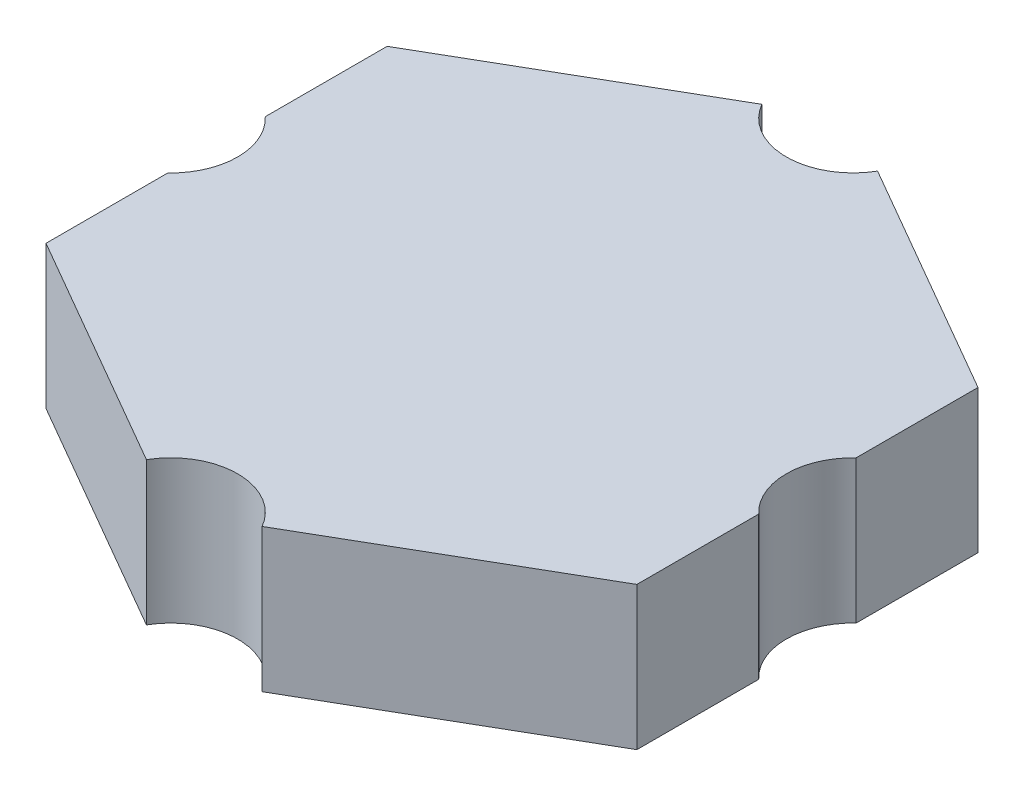
ISO-10303-21;
HEADER;
FILE_DESCRIPTION(('STEP AP214'),'2;1');
FILE_NAME('part.step','',(''),(''),'','','');
FILE_SCHEMA(('AUTOMOTIVE_DESIGN { 1 0 10303 214 1 1 1 1 }'));
ENDSEC;
DATA;
#1=APPLICATION_CONTEXT('core data for automotive mechanical design processes');
#2=APPLICATION_PROTOCOL_DEFINITION('international standard','automotive_design',2000,#1);
#3=PRODUCT_CONTEXT('',#1,'mechanical');
#4=PRODUCT('Part','Part','',(#3));
#5=PRODUCT_RELATED_PRODUCT_CATEGORY('part','',(#4));
#6=PRODUCT_DEFINITION_FORMATION('','',#4);
#7=PRODUCT_DEFINITION_CONTEXT('part definition',#1,'design');
#8=PRODUCT_DEFINITION('design','',#6,#7);
#9=PRODUCT_DEFINITION_SHAPE('','',#8);
#10=(LENGTH_UNIT() NAMED_UNIT(*) SI_UNIT(.MILLI.,.METRE.));
#11=(NAMED_UNIT(*) PLANE_ANGLE_UNIT() SI_UNIT($,.RADIAN.));
#12=(NAMED_UNIT(*) SI_UNIT($,.STERADIAN.) SOLID_ANGLE_UNIT());
#13=UNCERTAINTY_MEASURE_WITH_UNIT(LENGTH_MEASURE(1.E-05),#10,'distance_accuracy_value','');
#14=(GEOMETRIC_REPRESENTATION_CONTEXT(3) GLOBAL_UNCERTAINTY_ASSIGNED_CONTEXT((#13)) GLOBAL_UNIT_ASSIGNED_CONTEXT((#10,
#11,#12)) REPRESENTATION_CONTEXT('',''));
#15=CARTESIAN_POINT('',(0.,0.,0.));
#16=DIRECTION('',(0.,0.,1.));
#17=DIRECTION('',(1.,0.,0.));
#18=AXIS2_PLACEMENT_3D('',#15,#16,#17);
#19=CARTESIAN_POINT('',(-6.19208163705874,3.,-3.575));
#20=DIRECTION('',(1.,0.,0.));
#21=DIRECTION('',(0.,0.,-1.));
#22=AXIS2_PLACEMENT_3D('',#19,#20,#21);
#23=PLANE('',#22);
#24=DIRECTION('',(0.,0.,1.));
#25=VECTOR('',#24,1.);
#26=CARTESIAN_POINT('',(-6.19208163705874,0.,-3.575));
#27=LINE('',#26,#25);
#28=CARTESIAN_POINT('',(-6.19208163705874,0.,-3.575));
#29=VERTEX_POINT('',#28);
#30=CARTESIAN_POINT('',(-6.19208163705874,0.,-1.02097620439455));
#31=VERTEX_POINT('',#30);
#32=EDGE_CURVE('E167',#29,#31,#27,.T.);
#33=ORIENTED_EDGE('',*,*,#32,.T.);
#34=DIRECTION('',(0.,1.,0.));
#35=VECTOR('',#34,1.);
#36=CARTESIAN_POINT('',(-6.19208163705874,-6.45,-1.02097620439455));
#37=LINE('',#36,#35);
#38=CARTESIAN_POINT('',(-6.19208163705874,3.,-1.02097620439455));
#39=VERTEX_POINT('',#38);
#40=EDGE_CURVE('E48',#31,#39,#37,.T.);
#41=ORIENTED_EDGE('',*,*,#40,.T.);
#42=DIRECTION('',(0.,0.,1.));
#43=VECTOR('',#42,1.);
#44=CARTESIAN_POINT('',(-6.19208163705874,3.,-3.575));
#45=LINE('',#44,#43);
#46=CARTESIAN_POINT('',(-6.19208163705874,3.,-3.575));
#47=VERTEX_POINT('',#46);
#48=EDGE_CURVE('E138',#47,#39,#45,.T.);
#49=ORIENTED_EDGE('',*,*,#48,.F.);
#50=DIRECTION('',(0.,-1.,0.));
#51=VECTOR('',#50,1.);
#52=CARTESIAN_POINT('',(-6.19208163705874,3.,-3.575));
#53=LINE('',#52,#51);
#54=EDGE_CURVE('E185',#47,#29,#53,.T.);
#55=ORIENTED_EDGE('',*,*,#54,.T.);
#56=EDGE_LOOP('',(#33,#41,#49,#55));
#57=FACE_BOUND('',#56,.T.);
#58=ADVANCED_FACE('F33',(#57),#23,.F.);
#59=CARTESIAN_POINT('',(6.19208163705874,3.,3.575));
#60=DIRECTION('',(-1.,0.,0.));
#61=DIRECTION('',(0.,0.,1.));
#62=AXIS2_PLACEMENT_3D('',#59,#60,#61);
#63=PLANE('',#62);
#64=DIRECTION('',(0.,0.,-1.));
#65=VECTOR('',#64,1.);
#66=CARTESIAN_POINT('',(6.19208163705874,0.,3.575));
#67=LINE('',#66,#65);
#68=CARTESIAN_POINT('',(6.19208163705874,0.,3.575));
#69=VERTEX_POINT('',#68);
#70=CARTESIAN_POINT('',(6.19208163705874,0.,1.02097620439417));
#71=VERTEX_POINT('',#70);
#72=EDGE_CURVE('E176',#69,#71,#67,.T.);
#73=ORIENTED_EDGE('',*,*,#72,.T.);
#74=DIRECTION('',(0.,1.,0.));
#75=VECTOR('',#74,1.);
#76=CARTESIAN_POINT('',(6.19208163705874,-6.45,1.02097620439417));
#77=LINE('',#76,#75);
#78=CARTESIAN_POINT('',(6.19208163705874,3.,1.02097620439417));
#79=VERTEX_POINT('',#78);
#80=EDGE_CURVE('E204',#71,#79,#77,.T.);
#81=ORIENTED_EDGE('',*,*,#80,.T.);
#82=DIRECTION('',(0.,0.,-1.));
#83=VECTOR('',#82,1.);
#84=CARTESIAN_POINT('',(6.19208163705874,3.,3.575));
#85=LINE('',#84,#83);
#86=CARTESIAN_POINT('',(6.19208163705874,3.,3.575));
#87=VERTEX_POINT('',#86);
#88=EDGE_CURVE('E156',#87,#79,#85,.T.);
#89=ORIENTED_EDGE('',*,*,#88,.F.);
#90=DIRECTION('',(0.,-1.,0.));
#91=VECTOR('',#90,1.);
#92=CARTESIAN_POINT('',(6.19208163705874,3.,3.575));
#93=LINE('',#92,#91);
#94=EDGE_CURVE('E181',#87,#69,#93,.T.);
#95=ORIENTED_EDGE('',*,*,#94,.T.);
#96=EDGE_LOOP('',(#73,#81,#89,#95));
#97=FACE_BOUND('',#96,.T.);
#98=ADVANCED_FACE('F202',(#97),#63,.F.);
#99=CARTESIAN_POINT('',(6.19208163705873,3.,-3.575));
#100=DIRECTION('',(-0.5,0.,0.866025403784439));
#101=DIRECTION('',(0.866025403784439,0.,0.5));
#102=AXIS2_PLACEMENT_3D('',#99,#100,#101);
#103=PLANE('',#102);
#104=DIRECTION('',(-0.866025403784439,0.,-0.5));
#105=VECTOR('',#104,1.);
#106=CARTESIAN_POINT('',(6.19208163705873,0.,-3.575));
#107=LINE('',#106,#105);
#108=CARTESIAN_POINT('',(6.19208163705873,0.,-3.575));
#109=VERTEX_POINT('',#108);
#110=CARTESIAN_POINT('',(1.21243556529821,0.,-6.45));
#111=VERTEX_POINT('',#110);
#112=EDGE_CURVE('E160',#109,#111,#107,.T.);
#113=ORIENTED_EDGE('',*,*,#112,.T.);
#114=DIRECTION('',(0.,1.,0.));
#115=VECTOR('',#114,1.);
#116=CARTESIAN_POINT('',(1.21243556529821,-6.45,-6.45));
#117=LINE('',#116,#115);
#118=CARTESIAN_POINT('',(1.21243556529821,3.,-6.45));
#119=VERTEX_POINT('',#118);
#120=EDGE_CURVE('E164',#111,#119,#117,.T.);
#121=ORIENTED_EDGE('',*,*,#120,.T.);
#122=DIRECTION('',(-0.866025403784439,0.,-0.5));
#123=VECTOR('',#122,1.);
#124=CARTESIAN_POINT('',(6.19208163705873,3.,-3.575));
#125=LINE('',#124,#123);
#126=CARTESIAN_POINT('',(6.19208163705873,3.,-3.575));
#127=VERTEX_POINT('',#126);
#128=EDGE_CURVE('E148',#127,#119,#125,.T.);
#129=ORIENTED_EDGE('',*,*,#128,.F.);
#130=DIRECTION('',(0.,-1.,0.));
#131=VECTOR('',#130,1.);
#132=CARTESIAN_POINT('',(6.19208163705873,3.,-3.575));
#133=LINE('',#132,#131);
#134=EDGE_CURVE('E159',#127,#109,#133,.T.);
#135=ORIENTED_EDGE('',*,*,#134,.T.);
#136=EDGE_LOOP('',(#113,#121,#129,#135));
#137=FACE_BOUND('',#136,.T.);
#138=ADVANCED_FACE('F35',(#137),#103,.F.);
#139=CARTESIAN_POINT('',(0.,3.,-7.15));
#140=DIRECTION('',(0.5,0.,0.866025403784438));
#141=DIRECTION('',(0.866025403784439,0.,-0.5));
#142=AXIS2_PLACEMENT_3D('',#139,#140,#141);
#143=PLANE('',#142);
#144=DIRECTION('',(-0.866025403784439,0.,0.5));
#145=VECTOR('',#144,1.);
#146=CARTESIAN_POINT('',(0.,3.,-7.15));
#147=LINE('',#146,#145);
#148=CARTESIAN_POINT('',(-1.21243556529822,3.,-6.45));
#149=VERTEX_POINT('',#148);
#150=EDGE_CURVE('E145',#149,#47,#147,.T.);
#151=ORIENTED_EDGE('',*,*,#150,.F.);
#152=DIRECTION('',(0.,1.,0.));
#153=VECTOR('',#152,1.);
#154=CARTESIAN_POINT('',(-1.21243556529822,-6.45,-6.45));
#155=LINE('',#154,#153);
#156=CARTESIAN_POINT('',(-1.21243556529822,0.,-6.45));
#157=VERTEX_POINT('',#156);
#158=EDGE_CURVE('E226',#149,#157,#155,.F.);
#159=ORIENTED_EDGE('',*,*,#158,.T.);
#160=DIRECTION('',(-0.866025403784439,0.,0.5));
#161=VECTOR('',#160,1.);
#162=CARTESIAN_POINT('',(0.,0.,-7.15));
#163=LINE('',#162,#161);
#164=EDGE_CURVE('E163',#157,#29,#163,.T.);
#165=ORIENTED_EDGE('',*,*,#164,.T.);
#166=ORIENTED_EDGE('',*,*,#54,.F.);
#167=EDGE_LOOP('',(#151,#159,#165,#166));
#168=FACE_BOUND('',#167,.T.);
#169=ADVANCED_FACE('F242',(#168),#143,.F.);
#170=CARTESIAN_POINT('',(-6.19208163705874,3.,1.02097620439495));
#171=VERTEX_POINT('',#170);
#172=CARTESIAN_POINT('',(-6.19208163705874,3.,3.575));
#173=VERTEX_POINT('',#172);
#174=EDGE_CURVE('E135',#171,#173,#45,.T.);
#175=ORIENTED_EDGE('',*,*,#174,.F.);
#176=DIRECTION('',(0.,1.,0.));
#177=VECTOR('',#176,1.);
#178=CARTESIAN_POINT('',(-6.19208163705874,-6.45,1.02097620439495));
#179=LINE('',#178,#177);
#180=CARTESIAN_POINT('',(-6.19208163705874,0.,1.02097620439495));
#181=VERTEX_POINT('',#180);
#182=EDGE_CURVE('E120',#171,#181,#179,.F.);
#183=ORIENTED_EDGE('',*,*,#182,.T.);
#184=CARTESIAN_POINT('',(-6.19208163705874,0.,3.575));
#185=VERTEX_POINT('',#184);
#186=EDGE_CURVE('E166',#181,#185,#27,.T.);
#187=ORIENTED_EDGE('',*,*,#186,.T.);
#188=DIRECTION('',(0.,-1.,0.));
#189=VECTOR('',#188,1.);
#190=CARTESIAN_POINT('',(-6.19208163705874,3.,3.575));
#191=LINE('',#190,#189);
#192=EDGE_CURVE('E143',#173,#185,#191,.T.);
#193=ORIENTED_EDGE('',*,*,#192,.F.);
#194=EDGE_LOOP('',(#175,#183,#187,#193));
#195=FACE_BOUND('',#194,.T.);
#196=ADVANCED_FACE('F141',(#195),#23,.F.);
#197=CARTESIAN_POINT('',(-6.19208163705874,3.,3.575));
#198=DIRECTION('',(0.5,0.,-0.866025403784439));
#199=DIRECTION('',(-0.866025403784439,0.,-0.5));
#200=AXIS2_PLACEMENT_3D('',#197,#198,#199);
#201=PLANE('',#200);
#202=DIRECTION('',(0.866025403784439,0.,0.5));
#203=VECTOR('',#202,1.);
#204=CARTESIAN_POINT('',(-6.19208163705874,0.,3.575));
#205=LINE('',#204,#203);
#206=CARTESIAN_POINT('',(-1.21243556529791,0.,6.45000000000018));
#207=VERTEX_POINT('',#206);
#208=EDGE_CURVE('E170',#185,#207,#205,.T.);
#209=ORIENTED_EDGE('',*,*,#208,.T.);
#210=DIRECTION('',(0.,1.,0.));
#211=VECTOR('',#210,1.);
#212=CARTESIAN_POINT('',(-1.21243556529791,-6.45,6.45000000000018));
#213=LINE('',#212,#211);
#214=CARTESIAN_POINT('',(-1.21243556529791,3.,6.45000000000018));
#215=VERTEX_POINT('',#214);
#216=EDGE_CURVE('E56',#207,#215,#213,.T.);
#217=ORIENTED_EDGE('',*,*,#216,.T.);
#218=DIRECTION('',(0.866025403784439,0.,0.5));
#219=VECTOR('',#218,1.);
#220=CARTESIAN_POINT('',(-6.19208163705874,3.,3.575));
#221=LINE('',#220,#219);
#222=EDGE_CURVE('E147',#173,#215,#221,.T.);
#223=ORIENTED_EDGE('',*,*,#222,.F.);
#224=ORIENTED_EDGE('',*,*,#192,.T.);
#225=EDGE_LOOP('',(#209,#217,#223,#224));
#226=FACE_BOUND('',#225,.T.);
#227=ADVANCED_FACE('F213',(#226),#201,.F.);
#228=CARTESIAN_POINT('',(0.,3.,7.15));
#229=DIRECTION('',(-0.5,0.,-0.866025403784439));
#230=DIRECTION('',(-0.866025403784439,0.,0.5));
#231=AXIS2_PLACEMENT_3D('',#228,#229,#230);
#232=PLANE('',#231);
#233=DIRECTION('',(0.866025403784439,0.,-0.5));
#234=VECTOR('',#233,1.);
#235=CARTESIAN_POINT('',(0.,3.,7.15));
#236=LINE('',#235,#234);
#237=CARTESIAN_POINT('',(1.21243556529852,3.,6.44999999999983));
#238=VERTEX_POINT('',#237);
#239=EDGE_CURVE('E153',#238,#87,#236,.T.);
#240=ORIENTED_EDGE('',*,*,#239,.F.);
#241=DIRECTION('',(0.,1.,0.));
#242=VECTOR('',#241,1.);
#243=CARTESIAN_POINT('',(1.21243556529852,-6.45,6.44999999999983));
#244=LINE('',#243,#242);
#245=CARTESIAN_POINT('',(1.21243556529852,0.,6.44999999999983));
#246=VERTEX_POINT('',#245);
#247=EDGE_CURVE('E210',#238,#246,#244,.F.);
#248=ORIENTED_EDGE('',*,*,#247,.T.);
#249=DIRECTION('',(0.866025403784439,0.,-0.5));
#250=VECTOR('',#249,1.);
#251=CARTESIAN_POINT('',(0.,0.,7.15));
#252=LINE('',#251,#250);
#253=EDGE_CURVE('E173',#246,#69,#252,.T.);
#254=ORIENTED_EDGE('',*,*,#253,.T.);
#255=ORIENTED_EDGE('',*,*,#94,.F.);
#256=EDGE_LOOP('',(#240,#248,#254,#255));
#257=FACE_BOUND('',#256,.T.);
#258=ADVANCED_FACE('F208',(#257),#232,.F.);
#259=CARTESIAN_POINT('',(6.19208163705874,3.,-1.02097620439458));
#260=VERTEX_POINT('',#259);
#261=EDGE_CURVE('E155',#260,#127,#85,.T.);
#262=ORIENTED_EDGE('',*,*,#261,.F.);
#263=DIRECTION('',(0.,1.,0.));
#264=VECTOR('',#263,1.);
#265=CARTESIAN_POINT('',(6.19208163705874,-6.45,-1.02097620439458));
#266=LINE('',#265,#264);
#267=CARTESIAN_POINT('',(6.19208163705874,0.,-1.02097620439458));
#268=VERTEX_POINT('',#267);
#269=EDGE_CURVE('E223',#260,#268,#266,.F.);
#270=ORIENTED_EDGE('',*,*,#269,.T.);
#271=EDGE_CURVE('E175',#268,#109,#67,.T.);
#272=ORIENTED_EDGE('',*,*,#271,.T.);
#273=ORIENTED_EDGE('',*,*,#134,.F.);
#274=EDGE_LOOP('',(#262,#270,#272,#273));
#275=FACE_BOUND('',#274,.T.);
#276=ADVANCED_FACE('F250',(#275),#63,.F.);
#277=CARTESIAN_POINT('',(0.,3.,0.));
#278=DIRECTION('',(0.,1.,0.));
#279=DIRECTION('',(0.,0.,1.));
#280=AXIS2_PLACEMENT_3D('',#277,#278,#279);
#281=PLANE('',#280);
#282=CARTESIAN_POINT('',(0.,3.,-7.15));
#283=DIRECTION('',(0.,1.,0.));
#284=DIRECTION('',(0.,0.,1.));
#285=AXIS2_PLACEMENT_3D('',#282,#283,#284);
#286=CIRCLE('',#285,1.4);
#287=EDGE_CURVE('E128',#149,#119,#286,.T.);
#288=ORIENTED_EDGE('',*,*,#287,.F.);
#289=ORIENTED_EDGE('',*,*,#150,.T.);
#290=ORIENTED_EDGE('',*,*,#48,.T.);
#291=CARTESIAN_POINT('',(-7.1499999999998,3.,2.02777411196693E-13));
#292=DIRECTION('',(0.,1.,0.));
#293=DIRECTION('',(0.,0.,1.));
#294=AXIS2_PLACEMENT_3D('',#291,#292,#293);
#295=CIRCLE('',#294,1.4);
#296=EDGE_CURVE('E123',#171,#39,#295,.T.);
#297=ORIENTED_EDGE('',*,*,#296,.F.);
#298=ORIENTED_EDGE('',*,*,#174,.T.);
#299=ORIENTED_EDGE('',*,*,#222,.T.);
#300=CARTESIAN_POINT('',(4.02092781214988E-13,3.,7.15));
#301=DIRECTION('',(0.,1.,0.));
#302=DIRECTION('',(0.,0.,1.));
#303=AXIS2_PLACEMENT_3D('',#300,#301,#302);
#304=CIRCLE('',#303,1.4);
#305=EDGE_CURVE('E139',#238,#215,#304,.T.);
#306=ORIENTED_EDGE('',*,*,#305,.F.);
#307=ORIENTED_EDGE('',*,*,#239,.T.);
#308=ORIENTED_EDGE('',*,*,#88,.T.);
#309=CARTESIAN_POINT('',(7.1500000000002,3.,-2.01901788735303E-13));
#310=DIRECTION('',(0.,1.,0.));
#311=DIRECTION('',(0.,0.,1.));
#312=AXIS2_PLACEMENT_3D('',#309,#310,#311);
#313=CIRCLE('',#312,1.4);
#314=EDGE_CURVE('E215',#260,#79,#313,.T.);
#315=ORIENTED_EDGE('',*,*,#314,.F.);
#316=ORIENTED_EDGE('',*,*,#261,.T.);
#317=ORIENTED_EDGE('',*,*,#128,.T.);
#318=EDGE_LOOP('',(#288,#289,#290,#297,#298,#299,#306,#307,#308,#315,#316,#317));
#319=FACE_BOUND('',#318,.T.);
#320=ADVANCED_FACE('F133',(#319),#281,.T.);
#321=CARTESIAN_POINT('',(0.,0.,0.));
#322=DIRECTION('',(0.,1.,0.));
#323=DIRECTION('',(0.,0.,1.));
#324=AXIS2_PLACEMENT_3D('',#321,#322,#323);
#325=PLANE('',#324);
#326=ORIENTED_EDGE('',*,*,#164,.F.);
#327=CARTESIAN_POINT('',(0.,0.,-7.15));
#328=DIRECTION('',(0.,1.,0.));
#329=DIRECTION('',(0.,0.,1.));
#330=AXIS2_PLACEMENT_3D('',#327,#328,#329);
#331=CIRCLE('',#330,1.4);
#332=EDGE_CURVE('E11',#157,#111,#331,.T.);
#333=ORIENTED_EDGE('',*,*,#332,.T.);
#334=ORIENTED_EDGE('',*,*,#112,.F.);
#335=ORIENTED_EDGE('',*,*,#271,.F.);
#336=CARTESIAN_POINT('',(7.1500000000002,0.,-2.01901788735303E-13));
#337=DIRECTION('',(0.,1.,0.));
#338=DIRECTION('',(0.,0.,1.));
#339=AXIS2_PLACEMENT_3D('',#336,#337,#338);
#340=CIRCLE('',#339,1.4);
#341=EDGE_CURVE('E41',#268,#71,#340,.T.);
#342=ORIENTED_EDGE('',*,*,#341,.T.);
#343=ORIENTED_EDGE('',*,*,#72,.F.);
#344=ORIENTED_EDGE('',*,*,#253,.F.);
#345=CARTESIAN_POINT('',(4.02092781214988E-13,0.,7.15));
#346=DIRECTION('',(0.,1.,0.));
#347=DIRECTION('',(0.,0.,1.));
#348=AXIS2_PLACEMENT_3D('',#345,#346,#347);
#349=CIRCLE('',#348,1.4);
#350=EDGE_CURVE('E189',#246,#207,#349,.T.);
#351=ORIENTED_EDGE('',*,*,#350,.T.);
#352=ORIENTED_EDGE('',*,*,#208,.F.);
#353=ORIENTED_EDGE('',*,*,#186,.F.);
#354=CARTESIAN_POINT('',(-7.1499999999998,0.,2.02777411196693E-13));
#355=DIRECTION('',(0.,1.,0.));
#356=DIRECTION('',(0.,0.,1.));
#357=AXIS2_PLACEMENT_3D('',#354,#355,#356);
#358=CIRCLE('',#357,1.4);
#359=EDGE_CURVE('E124',#181,#31,#358,.T.);
#360=ORIENTED_EDGE('',*,*,#359,.T.);
#361=ORIENTED_EDGE('',*,*,#32,.F.);
#362=EDGE_LOOP('',(#326,#333,#334,#335,#342,#343,#344,#351,#352,#353,#360,#361));
#363=FACE_BOUND('',#362,.T.);
#364=ADVANCED_FACE('F195',(#363),#325,.F.);
#365=CARTESIAN_POINT('',(-7.1499999999998,-6.45,2.02777411196693E-13));
#366=DIRECTION('',(0.,1.,0.));
#367=DIRECTION('',(0.,0.,1.));
#368=AXIS2_PLACEMENT_3D('',#365,#366,#367);
#369=CYLINDRICAL_SURFACE('',#368,1.4);
#370=ORIENTED_EDGE('',*,*,#359,.F.);
#371=ORIENTED_EDGE('',*,*,#182,.F.);
#372=ORIENTED_EDGE('',*,*,#296,.T.);
#373=ORIENTED_EDGE('',*,*,#40,.F.);
#374=EDGE_LOOP('',(#370,#371,#372,#373));
#375=FACE_BOUND('',#374,.T.);
#376=ADVANCED_FACE('F122',(#375),#369,.F.);
#377=CARTESIAN_POINT('',(4.02092781214988E-13,-6.45,7.15));
#378=DIRECTION('',(0.,1.,0.));
#379=DIRECTION('',(0.,0.,1.));
#380=AXIS2_PLACEMENT_3D('',#377,#378,#379);
#381=CYLINDRICAL_SURFACE('',#380,1.4);
#382=ORIENTED_EDGE('',*,*,#350,.F.);
#383=ORIENTED_EDGE('',*,*,#247,.F.);
#384=ORIENTED_EDGE('',*,*,#305,.T.);
#385=ORIENTED_EDGE('',*,*,#216,.F.);
#386=EDGE_LOOP('',(#382,#383,#384,#385));
#387=FACE_BOUND('',#386,.T.);
#388=ADVANCED_FACE('F281',(#387),#381,.F.);
#389=CARTESIAN_POINT('',(7.1500000000002,-6.45,-2.01901788735303E-13));
#390=DIRECTION('',(0.,1.,0.));
#391=DIRECTION('',(0.,0.,1.));
#392=AXIS2_PLACEMENT_3D('',#389,#390,#391);
#393=CYLINDRICAL_SURFACE('',#392,1.4);
#394=ORIENTED_EDGE('',*,*,#341,.F.);
#395=ORIENTED_EDGE('',*,*,#269,.F.);
#396=ORIENTED_EDGE('',*,*,#314,.T.);
#397=ORIENTED_EDGE('',*,*,#80,.F.);
#398=EDGE_LOOP('',(#394,#395,#396,#397));
#399=FACE_BOUND('',#398,.T.);
#400=ADVANCED_FACE('F290',(#399),#393,.F.);
#401=CARTESIAN_POINT('',(0.,-6.45,-7.15));
#402=DIRECTION('',(0.,1.,0.));
#403=DIRECTION('',(0.,0.,1.));
#404=AXIS2_PLACEMENT_3D('',#401,#402,#403);
#405=CYLINDRICAL_SURFACE('',#404,1.4);
#406=ORIENTED_EDGE('',*,*,#332,.F.);
#407=ORIENTED_EDGE('',*,*,#158,.F.);
#408=ORIENTED_EDGE('',*,*,#287,.T.);
#409=ORIENTED_EDGE('',*,*,#120,.F.);
#410=EDGE_LOOP('',(#406,#407,#408,#409));
#411=FACE_BOUND('',#410,.T.);
#412=ADVANCED_FACE('F238',(#411),#405,.F.);
#413=CLOSED_SHELL('',(#58,#98,#138,#169,#196,#227,#258,#276,#320,#364,#376,#388,#400,#412));
#414=MANIFOLD_SOLID_BREP('B2',#413);
#415=ADVANCED_BREP_SHAPE_REPRESENTATION('',(#18,#414),#14);
#416=SHAPE_DEFINITION_REPRESENTATION(#9,#415);
ENDSEC;
END-ISO-10303-21;
